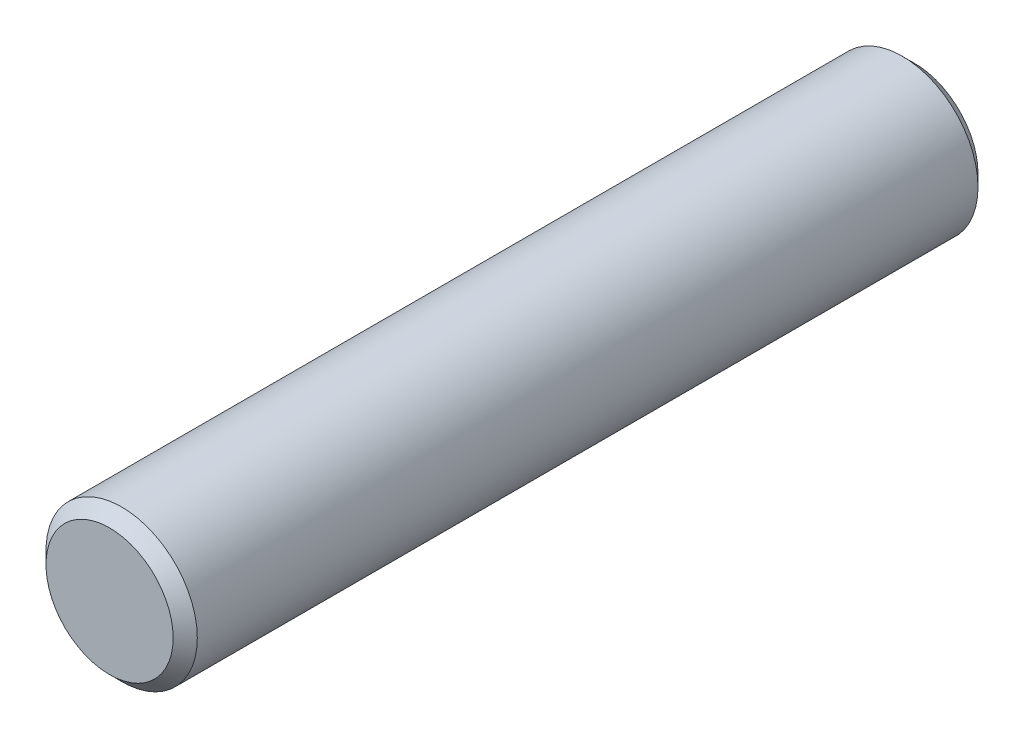
ISO-10303-21;
HEADER;
FILE_DESCRIPTION(('STEP AP214'),'2;1');
FILE_NAME('part.step','',(''),(''),'','','');
FILE_SCHEMA(('AUTOMOTIVE_DESIGN { 1 0 10303 214 1 1 1 1 }'));
ENDSEC;
DATA;
#1=APPLICATION_CONTEXT('core data for automotive mechanical design processes');
#2=APPLICATION_PROTOCOL_DEFINITION('international standard','automotive_design',2000,#1);
#3=PRODUCT_CONTEXT('',#1,'mechanical');
#4=PRODUCT('Part','Part','',(#3));
#5=PRODUCT_RELATED_PRODUCT_CATEGORY('part','',(#4));
#6=PRODUCT_DEFINITION_FORMATION('','',#4);
#7=PRODUCT_DEFINITION_CONTEXT('part definition',#1,'design');
#8=PRODUCT_DEFINITION('design','',#6,#7);
#9=PRODUCT_DEFINITION_SHAPE('','',#8);
#10=(LENGTH_UNIT() NAMED_UNIT(*) SI_UNIT(.MILLI.,.METRE.));
#11=(NAMED_UNIT(*) PLANE_ANGLE_UNIT() SI_UNIT($,.RADIAN.));
#12=(NAMED_UNIT(*) SI_UNIT($,.STERADIAN.) SOLID_ANGLE_UNIT());
#13=UNCERTAINTY_MEASURE_WITH_UNIT(LENGTH_MEASURE(1.E-05),#10,'distance_accuracy_value','');
#14=(GEOMETRIC_REPRESENTATION_CONTEXT(3) GLOBAL_UNCERTAINTY_ASSIGNED_CONTEXT((#13)) GLOBAL_UNIT_ASSIGNED_CONTEXT((#10,
#11,#12)) REPRESENTATION_CONTEXT('',''));
#15=CARTESIAN_POINT('',(0.,0.,0.));
#16=DIRECTION('',(0.,0.,1.));
#17=DIRECTION('',(1.,0.,0.));
#18=AXIS2_PLACEMENT_3D('',#15,#16,#17);
#19=CARTESIAN_POINT('',(0.,0.,12.7));
#20=DIRECTION('',(0.,0.,-1.));
#21=DIRECTION('',(-1.,0.,0.));
#22=AXIS2_PLACEMENT_3D('',#19,#20,#21);
#23=CYLINDRICAL_SURFACE('',#22,2.3876);
#24=CARTESIAN_POINT('',(0.,0.,-12.319));
#25=DIRECTION('',(0.,0.,1.));
#26=DIRECTION('',(1.,0.,0.));
#27=AXIS2_PLACEMENT_3D('',#24,#25,#26);
#28=CIRCLE('',#27,2.3876);
#29=CARTESIAN_POINT('',(2.3876,0.,-12.319));
#30=VERTEX_POINT('',#29);
#31=EDGE_CURVE('E45',#30,#30,#28,.T.);
#32=ORIENTED_EDGE('',*,*,#31,.T.);
#33=EDGE_LOOP('',(#32));
#34=FACE_BOUND('',#33,.T.);
#35=CARTESIAN_POINT('',(0.,0.,12.319));
#36=DIRECTION('',(0.,0.,1.));
#37=DIRECTION('',(1.,0.,0.));
#38=AXIS2_PLACEMENT_3D('',#35,#36,#37);
#39=CIRCLE('',#38,2.3876);
#40=CARTESIAN_POINT('',(2.3876,0.,12.319));
#41=VERTEX_POINT('',#40);
#42=EDGE_CURVE('E49',#41,#41,#39,.F.);
#43=ORIENTED_EDGE('',*,*,#42,.T.);
#44=EDGE_LOOP('',(#43));
#45=FACE_BOUND('',#44,.T.);
#46=ADVANCED_FACE('F34',(#34,#45),#23,.T.);
#47=CARTESIAN_POINT('',(0.,0.,12.7));
#48=DIRECTION('',(0.,0.,1.));
#49=DIRECTION('',(1.,0.,0.));
#50=AXIS2_PLACEMENT_3D('',#47,#48,#49);
#51=PLANE('',#50);
#52=CARTESIAN_POINT('',(0.,0.,12.7));
#53=DIRECTION('',(0.,0.,1.));
#54=DIRECTION('',(1.,0.,0.));
#55=AXIS2_PLACEMENT_3D('',#52,#53,#54);
#56=CIRCLE('',#55,2.00660000000001);
#57=CARTESIAN_POINT('',(2.00660000000001,0.,12.7));
#58=VERTEX_POINT('',#57);
#59=EDGE_CURVE('E10',#58,#58,#56,.T.);
#60=ORIENTED_EDGE('',*,*,#59,.T.);
#61=EDGE_LOOP('',(#60));
#62=FACE_BOUND('',#61,.T.);
#63=ADVANCED_FACE('F65',(#62),#51,.T.);
#64=CARTESIAN_POINT('',(0.,0.,-12.7));
#65=DIRECTION('',(0.,0.,1.));
#66=DIRECTION('',(1.,0.,0.));
#67=AXIS2_PLACEMENT_3D('',#64,#65,#66);
#68=PLANE('',#67);
#69=CARTESIAN_POINT('',(0.,0.,-12.7));
#70=DIRECTION('',(0.,0.,1.));
#71=DIRECTION('',(1.,0.,0.));
#72=AXIS2_PLACEMENT_3D('',#69,#70,#71);
#73=CIRCLE('',#72,2.0066);
#74=CARTESIAN_POINT('',(2.0066,0.,-12.7));
#75=VERTEX_POINT('',#74);
#76=EDGE_CURVE('E41',#75,#75,#73,.F.);
#77=ORIENTED_EDGE('',*,*,#76,.T.);
#78=EDGE_LOOP('',(#77));
#79=FACE_BOUND('',#78,.T.);
#80=ADVANCED_FACE('F62',(#79),#68,.F.);
#81=CARTESIAN_POINT('',(0.,0.,-12.319));
#82=DIRECTION('',(0.,0.,1.));
#83=DIRECTION('',(1.,0.,0.));
#84=AXIS2_PLACEMENT_3D('',#81,#82,#83);
#85=CONICAL_SURFACE('',#84,2.3876,0.785398163397453);
#86=ORIENTED_EDGE('',*,*,#76,.F.);
#87=EDGE_LOOP('',(#86));
#88=FACE_BOUND('',#87,.T.);
#89=ORIENTED_EDGE('',*,*,#31,.F.);
#90=EDGE_LOOP('',(#89));
#91=FACE_BOUND('',#90,.T.);
#92=ADVANCED_FACE('F58',(#88,#91),#85,.T.);
#93=CARTESIAN_POINT('',(0.,0.,12.7));
#94=DIRECTION('',(0.,0.,-1.));
#95=DIRECTION('',(-1.,0.,0.));
#96=AXIS2_PLACEMENT_3D('',#93,#94,#95);
#97=CONICAL_SURFACE('',#96,2.00660000000001,0.785398163397448);
#98=ORIENTED_EDGE('',*,*,#42,.F.);
#99=EDGE_LOOP('',(#98));
#100=FACE_BOUND('',#99,.T.);
#101=ORIENTED_EDGE('',*,*,#59,.F.);
#102=EDGE_LOOP('',(#101));
#103=FACE_BOUND('',#102,.T.);
#104=ADVANCED_FACE('F36',(#100,#103),#97,.T.);
#105=CLOSED_SHELL('',(#46,#63,#80,#92,#104));
#106=MANIFOLD_SOLID_BREP('B2',#105);
#107=ADVANCED_BREP_SHAPE_REPRESENTATION('',(#18,#106),#14);
#108=SHAPE_DEFINITION_REPRESENTATION(#9,#107);
ENDSEC;
END-ISO-10303-21;
